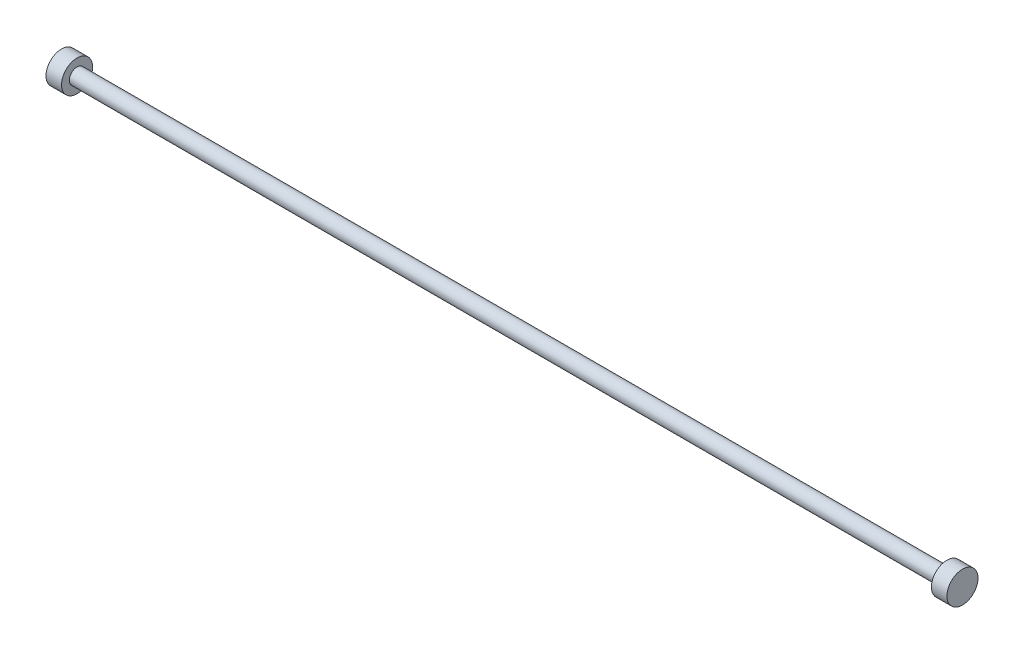
ISO-10303-21;
HEADER;
FILE_DESCRIPTION(('STEP AP214'),'2;1');
FILE_NAME('part.step','',(''),(''),'','','');
FILE_SCHEMA(('AUTOMOTIVE_DESIGN { 1 0 10303 214 1 1 1 1 }'));
ENDSEC;
DATA;
#1=APPLICATION_CONTEXT('core data for automotive mechanical design processes');
#2=APPLICATION_PROTOCOL_DEFINITION('international standard','automotive_design',2000,#1);
#3=PRODUCT_CONTEXT('',#1,'mechanical');
#4=PRODUCT('Part','Part','',(#3));
#5=PRODUCT_RELATED_PRODUCT_CATEGORY('part','',(#4));
#6=PRODUCT_DEFINITION_FORMATION('','',#4);
#7=PRODUCT_DEFINITION_CONTEXT('part definition',#1,'design');
#8=PRODUCT_DEFINITION('design','',#6,#7);
#9=PRODUCT_DEFINITION_SHAPE('','',#8);
#10=(LENGTH_UNIT() NAMED_UNIT(*) SI_UNIT(.MILLI.,.METRE.));
#11=(NAMED_UNIT(*) PLANE_ANGLE_UNIT() SI_UNIT($,.RADIAN.));
#12=(NAMED_UNIT(*) SI_UNIT($,.STERADIAN.) SOLID_ANGLE_UNIT());
#13=UNCERTAINTY_MEASURE_WITH_UNIT(LENGTH_MEASURE(1.E-05),#10,'distance_accuracy_value','');
#14=(GEOMETRIC_REPRESENTATION_CONTEXT(3) GLOBAL_UNCERTAINTY_ASSIGNED_CONTEXT((#13)) GLOBAL_UNIT_ASSIGNED_CONTEXT((#10,
#11,#12)) REPRESENTATION_CONTEXT('',''));
#15=CARTESIAN_POINT('',(0.,0.,0.));
#16=DIRECTION('',(0.,0.,1.));
#17=DIRECTION('',(1.,0.,0.));
#18=AXIS2_PLACEMENT_3D('',#15,#16,#17);
#19=CARTESIAN_POINT('',(560.,0.,0.));
#20=DIRECTION('',(-1.,0.,0.));
#21=DIRECTION('',(0.,0.,1.));
#22=AXIS2_PLACEMENT_3D('',#19,#20,#21);
#23=CYLINDRICAL_SURFACE('',#22,5.);
#24=CARTESIAN_POINT('',(560.,0.,0.));
#25=DIRECTION('',(1.,0.,0.));
#26=DIRECTION('',(0.,0.,-1.));
#27=AXIS2_PLACEMENT_3D('',#24,#25,#26);
#28=CIRCLE('',#27,5.);
#29=CARTESIAN_POINT('',(560.,0.,-5.));
#30=VERTEX_POINT('',#29);
#31=EDGE_CURVE('E10',#30,#30,#28,.T.);
#32=ORIENTED_EDGE('',*,*,#31,.F.);
#33=EDGE_LOOP('',(#32));
#34=FACE_BOUND('',#33,.T.);
#35=CARTESIAN_POINT('',(0.,0.,0.));
#36=DIRECTION('',(-1.,0.,0.));
#37=DIRECTION('',(0.,0.,1.));
#38=AXIS2_PLACEMENT_3D('',#35,#36,#37);
#39=CIRCLE('',#38,5.);
#40=CARTESIAN_POINT('',(0.,0.,5.));
#41=VERTEX_POINT('',#40);
#42=EDGE_CURVE('E45',#41,#41,#39,.T.);
#43=ORIENTED_EDGE('',*,*,#42,.F.);
#44=EDGE_LOOP('',(#43));
#45=FACE_BOUND('',#44,.T.);
#46=ADVANCED_FACE('F30',(#34,#45),#23,.T.);
#47=CARTESIAN_POINT('',(560.,0.,0.));
#48=DIRECTION('',(1.,0.,0.));
#49=DIRECTION('',(0.,0.,-1.));
#50=AXIS2_PLACEMENT_3D('',#47,#48,#49);
#51=PLANE('',#50);
#52=CARTESIAN_POINT('',(560.,0.,0.));
#53=DIRECTION('',(1.,0.,0.));
#54=DIRECTION('',(0.,0.,-1.));
#55=AXIS2_PLACEMENT_3D('',#52,#53,#54);
#56=CIRCLE('',#55,10.);
#57=CARTESIAN_POINT('',(560.,0.,-10.));
#58=VERTEX_POINT('',#57);
#59=EDGE_CURVE('E40',#58,#58,#56,.T.);
#60=ORIENTED_EDGE('',*,*,#59,.F.);
#61=EDGE_LOOP('',(#60));
#62=FACE_BOUND('',#61,.T.);
#63=ORIENTED_EDGE('',*,*,#31,.T.);
#64=EDGE_LOOP('',(#63));
#65=FACE_BOUND('',#64,.T.);
#66=ADVANCED_FACE('F72',(#62,#65),#51,.F.);
#67=CARTESIAN_POINT('',(570.,0.,0.));
#68=DIRECTION('',(-1.,0.,0.));
#69=DIRECTION('',(0.,0.,1.));
#70=AXIS2_PLACEMENT_3D('',#67,#68,#69);
#71=CYLINDRICAL_SURFACE('',#70,10.);
#72=CARTESIAN_POINT('',(570.,0.,0.));
#73=DIRECTION('',(1.,0.,0.));
#74=DIRECTION('',(0.,0.,-1.));
#75=AXIS2_PLACEMENT_3D('',#72,#73,#74);
#76=CIRCLE('',#75,10.);
#77=CARTESIAN_POINT('',(570.,0.,-10.));
#78=VERTEX_POINT('',#77);
#79=EDGE_CURVE('E36',#78,#78,#76,.T.);
#80=ORIENTED_EDGE('',*,*,#79,.F.);
#81=EDGE_LOOP('',(#80));
#82=FACE_BOUND('',#81,.T.);
#83=ORIENTED_EDGE('',*,*,#59,.T.);
#84=EDGE_LOOP('',(#83));
#85=FACE_BOUND('',#84,.T.);
#86=ADVANCED_FACE('F77',(#82,#85),#71,.T.);
#87=CARTESIAN_POINT('',(570.,0.,0.));
#88=DIRECTION('',(1.,0.,0.));
#89=DIRECTION('',(0.,0.,-1.));
#90=AXIS2_PLACEMENT_3D('',#87,#88,#89);
#91=PLANE('',#90);
#92=ORIENTED_EDGE('',*,*,#79,.T.);
#93=EDGE_LOOP('',(#92));
#94=FACE_BOUND('',#93,.T.);
#95=ADVANCED_FACE('F67',(#94),#91,.T.);
#96=CARTESIAN_POINT('',(0.,0.,0.));
#97=DIRECTION('',(-1.,0.,0.));
#98=DIRECTION('',(0.,0.,1.));
#99=AXIS2_PLACEMENT_3D('',#96,#97,#98);
#100=PLANE('',#99);
#101=CARTESIAN_POINT('',(0.,0.,0.));
#102=DIRECTION('',(-1.,0.,0.));
#103=DIRECTION('',(0.,0.,1.));
#104=AXIS2_PLACEMENT_3D('',#101,#102,#103);
#105=CIRCLE('',#104,10.);
#106=CARTESIAN_POINT('',(0.,0.,10.));
#107=VERTEX_POINT('',#106);
#108=EDGE_CURVE('E50',#107,#107,#105,.T.);
#109=ORIENTED_EDGE('',*,*,#108,.F.);
#110=EDGE_LOOP('',(#109));
#111=FACE_BOUND('',#110,.T.);
#112=ORIENTED_EDGE('',*,*,#42,.T.);
#113=EDGE_LOOP('',(#112));
#114=FACE_BOUND('',#113,.T.);
#115=ADVANCED_FACE('F61',(#111,#114),#100,.F.);
#116=CARTESIAN_POINT('',(-10.,0.,0.));
#117=DIRECTION('',(1.,0.,0.));
#118=DIRECTION('',(0.,0.,-1.));
#119=AXIS2_PLACEMENT_3D('',#116,#117,#118);
#120=CYLINDRICAL_SURFACE('',#119,10.);
#121=CARTESIAN_POINT('',(-10.,0.,0.));
#122=DIRECTION('',(-1.,0.,0.));
#123=DIRECTION('',(0.,0.,1.));
#124=AXIS2_PLACEMENT_3D('',#121,#122,#123);
#125=CIRCLE('',#124,10.);
#126=CARTESIAN_POINT('',(-10.,0.,10.));
#127=VERTEX_POINT('',#126);
#128=EDGE_CURVE('E49',#127,#127,#125,.T.);
#129=ORIENTED_EDGE('',*,*,#128,.F.);
#130=EDGE_LOOP('',(#129));
#131=FACE_BOUND('',#130,.T.);
#132=ORIENTED_EDGE('',*,*,#108,.T.);
#133=EDGE_LOOP('',(#132));
#134=FACE_BOUND('',#133,.T.);
#135=ADVANCED_FACE('F58',(#131,#134),#120,.T.);
#136=CARTESIAN_POINT('',(-10.,0.,0.));
#137=DIRECTION('',(-1.,0.,0.));
#138=DIRECTION('',(0.,0.,1.));
#139=AXIS2_PLACEMENT_3D('',#136,#137,#138);
#140=PLANE('',#139);
#141=ORIENTED_EDGE('',*,*,#128,.T.);
#142=EDGE_LOOP('',(#141));
#143=FACE_BOUND('',#142,.T.);
#144=ADVANCED_FACE('F56',(#143),#140,.T.);
#145=CLOSED_SHELL('',(#46,#66,#86,#95,#115,#135,#144));
#146=MANIFOLD_SOLID_BREP('B2',#145);
#147=ADVANCED_BREP_SHAPE_REPRESENTATION('',(#18,#146),#14);
#148=SHAPE_DEFINITION_REPRESENTATION(#9,#147);
ENDSEC;
END-ISO-10303-21;
